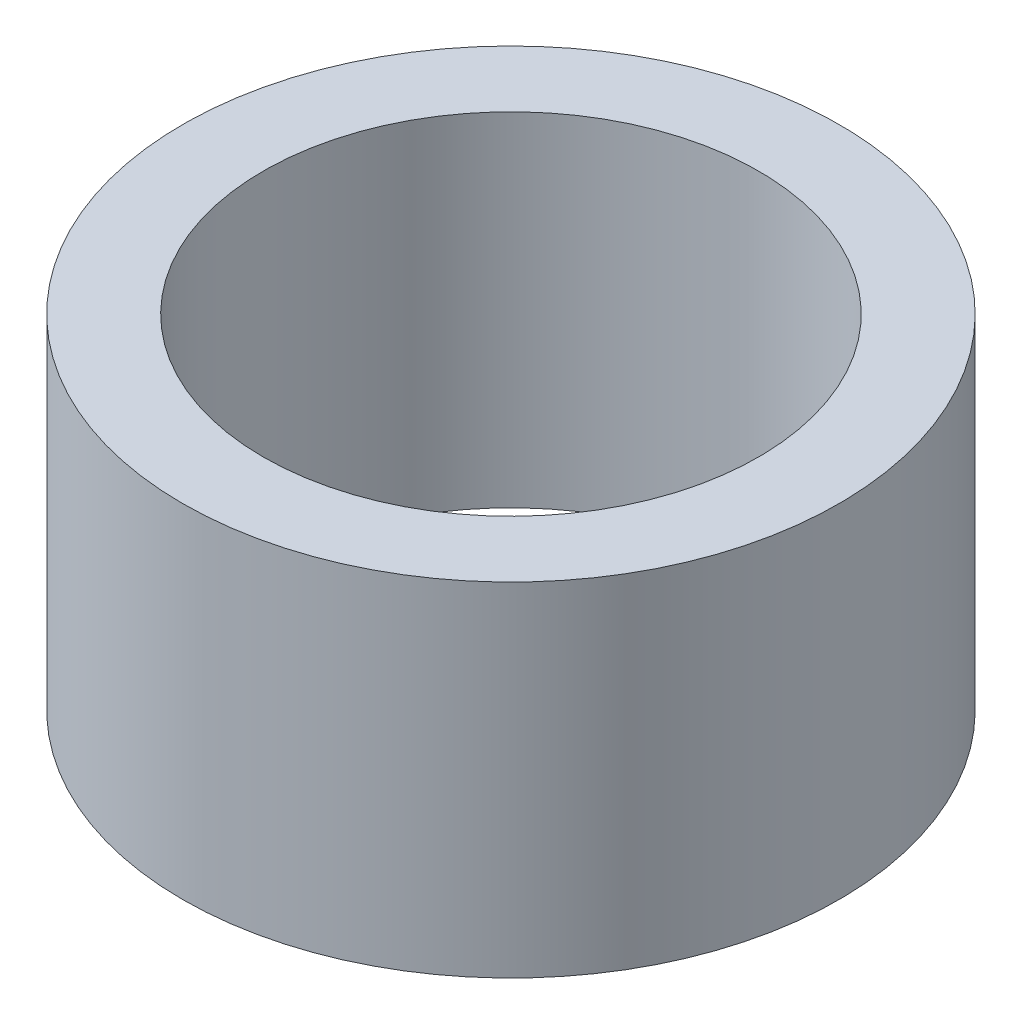
ISO-10303-21;
HEADER;
FILE_DESCRIPTION(('STEP AP214'),'2;1');
FILE_NAME('part.step','',(''),(''),'','','');
FILE_SCHEMA(('AUTOMOTIVE_DESIGN { 1 0 10303 214 1 1 1 1 }'));
ENDSEC;
DATA;
#1=APPLICATION_CONTEXT('core data for automotive mechanical design processes');
#2=APPLICATION_PROTOCOL_DEFINITION('international standard','automotive_design',2000,#1);
#3=PRODUCT_CONTEXT('',#1,'mechanical');
#4=PRODUCT('Part','Part','',(#3));
#5=PRODUCT_RELATED_PRODUCT_CATEGORY('part','',(#4));
#6=PRODUCT_DEFINITION_FORMATION('','',#4);
#7=PRODUCT_DEFINITION_CONTEXT('part definition',#1,'design');
#8=PRODUCT_DEFINITION('design','',#6,#7);
#9=PRODUCT_DEFINITION_SHAPE('','',#8);
#10=(LENGTH_UNIT() NAMED_UNIT(*) SI_UNIT(.MILLI.,.METRE.));
#11=(NAMED_UNIT(*) PLANE_ANGLE_UNIT() SI_UNIT($,.RADIAN.));
#12=(NAMED_UNIT(*) SI_UNIT($,.STERADIAN.) SOLID_ANGLE_UNIT());
#13=UNCERTAINTY_MEASURE_WITH_UNIT(LENGTH_MEASURE(1.E-05),#10,'distance_accuracy_value','');
#14=(GEOMETRIC_REPRESENTATION_CONTEXT(3) GLOBAL_UNCERTAINTY_ASSIGNED_CONTEXT((#13)) GLOBAL_UNIT_ASSIGNED_CONTEXT((#10,
#11,#12)) REPRESENTATION_CONTEXT('',''));
#15=CARTESIAN_POINT('',(0.,0.,0.));
#16=DIRECTION('',(0.,0.,1.));
#17=DIRECTION('',(1.,0.,0.));
#18=AXIS2_PLACEMENT_3D('',#15,#16,#17);
#19=CARTESIAN_POINT('',(0.,36.5649803093216,0.));
#20=DIRECTION('',(0.,-1.,0.));
#21=DIRECTION('',(0.,0.,-1.));
#22=AXIS2_PLACEMENT_3D('',#19,#20,#21);
#23=CYLINDRICAL_SURFACE('',#22,35.);
#24=CARTESIAN_POINT('',(0.,36.5649803093216,0.));
#25=DIRECTION('',(0.,1.,0.));
#26=DIRECTION('',(0.,0.,1.));
#27=AXIS2_PLACEMENT_3D('',#24,#25,#26);
#28=CIRCLE('',#27,35.);
#29=CARTESIAN_POINT('',(0.,36.5649803093216,35.));
#30=VERTEX_POINT('',#29);
#31=EDGE_CURVE('E10',#30,#30,#28,.T.);
#32=ORIENTED_EDGE('',*,*,#31,.F.);
#33=EDGE_LOOP('',(#32));
#34=FACE_BOUND('',#33,.T.);
#35=CARTESIAN_POINT('',(0.,0.,0.));
#36=DIRECTION('',(0.,1.,0.));
#37=DIRECTION('',(0.,0.,1.));
#38=AXIS2_PLACEMENT_3D('',#35,#36,#37);
#39=CIRCLE('',#38,35.);
#40=CARTESIAN_POINT('',(0.,0.,35.));
#41=VERTEX_POINT('',#40);
#42=EDGE_CURVE('E37',#41,#41,#39,.T.);
#43=ORIENTED_EDGE('',*,*,#42,.T.);
#44=EDGE_LOOP('',(#43));
#45=FACE_BOUND('',#44,.T.);
#46=ADVANCED_FACE('F40',(#34,#45),#23,.T.);
#47=CARTESIAN_POINT('',(0.,36.5649803093216,0.));
#48=DIRECTION('',(0.,1.,0.));
#49=DIRECTION('',(0.,0.,1.));
#50=AXIS2_PLACEMENT_3D('',#47,#48,#49);
#51=PLANE('',#50);
#52=CARTESIAN_POINT('',(0.,36.5649803093216,0.));
#53=DIRECTION('',(0.,1.,0.));
#54=DIRECTION('',(0.,0.,1.));
#55=AXIS2_PLACEMENT_3D('',#52,#53,#54);
#56=CIRCLE('',#55,26.4085072343011);
#57=CARTESIAN_POINT('',(0.,36.5649803093216,26.4085072343011));
#58=VERTEX_POINT('',#57);
#59=EDGE_CURVE('E50',#58,#58,#56,.T.);
#60=ORIENTED_EDGE('',*,*,#59,.F.);
#61=EDGE_LOOP('',(#60));
#62=FACE_BOUND('',#61,.T.);
#63=ORIENTED_EDGE('',*,*,#31,.T.);
#64=EDGE_LOOP('',(#63));
#65=FACE_BOUND('',#64,.T.);
#66=ADVANCED_FACE('F59',(#62,#65),#51,.T.);
#67=CARTESIAN_POINT('',(0.,0.,0.));
#68=DIRECTION('',(0.,1.,0.));
#69=DIRECTION('',(0.,0.,1.));
#70=AXIS2_PLACEMENT_3D('',#67,#68,#69);
#71=PLANE('',#70);
#72=CARTESIAN_POINT('',(0.,0.,0.));
#73=DIRECTION('',(0.,1.,0.));
#74=DIRECTION('',(0.,0.,1.));
#75=AXIS2_PLACEMENT_3D('',#72,#73,#74);
#76=CIRCLE('',#75,26.4085072343011);
#77=CARTESIAN_POINT('',(0.,0.,26.4085072343011));
#78=VERTEX_POINT('',#77);
#79=EDGE_CURVE('E47',#78,#78,#76,.T.);
#80=ORIENTED_EDGE('',*,*,#79,.T.);
#81=EDGE_LOOP('',(#80));
#82=FACE_BOUND('',#81,.T.);
#83=ORIENTED_EDGE('',*,*,#42,.F.);
#84=EDGE_LOOP('',(#83));
#85=FACE_BOUND('',#84,.T.);
#86=ADVANCED_FACE('F58',(#82,#85),#71,.F.);
#87=CARTESIAN_POINT('',(0.,36.5649803093216,0.));
#88=DIRECTION('',(0.,-1.,0.));
#89=DIRECTION('',(0.,0.,-1.));
#90=AXIS2_PLACEMENT_3D('',#87,#88,#89);
#91=CYLINDRICAL_SURFACE('',#90,26.4085072343011);
#92=ORIENTED_EDGE('',*,*,#59,.T.);
#93=EDGE_LOOP('',(#92));
#94=FACE_BOUND('',#93,.T.);
#95=ORIENTED_EDGE('',*,*,#79,.F.);
#96=EDGE_LOOP('',(#95));
#97=FACE_BOUND('',#96,.T.);
#98=ADVANCED_FACE('F54',(#94,#97),#91,.F.);
#99=CLOSED_SHELL('',(#46,#66,#86,#98));
#100=MANIFOLD_SOLID_BREP('B2',#99);
#101=ADVANCED_BREP_SHAPE_REPRESENTATION('',(#18,#100),#14);
#102=SHAPE_DEFINITION_REPRESENTATION(#9,#101);
ENDSEC;
END-ISO-10303-21;
